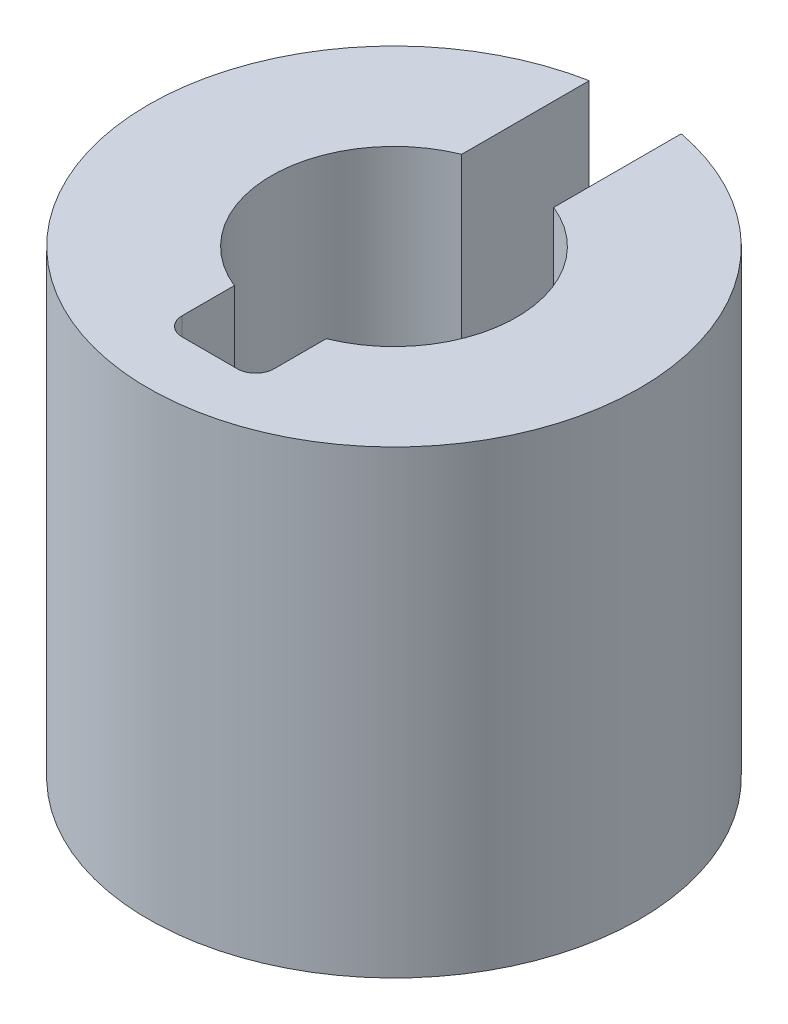
ISO-10303-21;
HEADER;
FILE_DESCRIPTION(('STEP AP214'),'2;1');
FILE_NAME('part.step','',(''),(''),'','','');
FILE_SCHEMA(('AUTOMOTIVE_DESIGN { 1 0 10303 214 1 1 1 1 }'));
ENDSEC;
DATA;
#1=APPLICATION_CONTEXT('core data for automotive mechanical design processes');
#2=APPLICATION_PROTOCOL_DEFINITION('international standard','automotive_design',2000,#1);
#3=PRODUCT_CONTEXT('',#1,'mechanical');
#4=PRODUCT('Part','Part','',(#3));
#5=PRODUCT_RELATED_PRODUCT_CATEGORY('part','',(#4));
#6=PRODUCT_DEFINITION_FORMATION('','',#4);
#7=PRODUCT_DEFINITION_CONTEXT('part definition',#1,'design');
#8=PRODUCT_DEFINITION('design','',#6,#7);
#9=PRODUCT_DEFINITION_SHAPE('','',#8);
#10=(LENGTH_UNIT() NAMED_UNIT(*) SI_UNIT(.MILLI.,.METRE.));
#11=(NAMED_UNIT(*) PLANE_ANGLE_UNIT() SI_UNIT($,.RADIAN.));
#12=(NAMED_UNIT(*) SI_UNIT($,.STERADIAN.) SOLID_ANGLE_UNIT());
#13=UNCERTAINTY_MEASURE_WITH_UNIT(LENGTH_MEASURE(1.E-05),#10,'distance_accuracy_value','');
#14=(GEOMETRIC_REPRESENTATION_CONTEXT(3) GLOBAL_UNCERTAINTY_ASSIGNED_CONTEXT((#13)) GLOBAL_UNIT_ASSIGNED_CONTEXT((#10,
#11,#12)) REPRESENTATION_CONTEXT('',''));
#15=CARTESIAN_POINT('',(0.,0.,0.));
#16=DIRECTION('',(0.,0.,1.));
#17=DIRECTION('',(1.,0.,0.));
#18=AXIS2_PLACEMENT_3D('',#15,#16,#17);
#19=CARTESIAN_POINT('',(-0.75,3.75,3.005));
#20=DIRECTION('',(0.,0.,1.));
#21=DIRECTION('',(1.,0.,0.));
#22=AXIS2_PLACEMENT_3D('',#19,#20,#21);
#23=PLANE('',#22);
#24=DIRECTION('',(0.,1.,0.));
#25=VECTOR('',#24,1.);
#26=CARTESIAN_POINT('',(-0.45,3.75,3.005));
#27=LINE('',#26,#25);
#28=CARTESIAN_POINT('',(-0.45,-3.75,3.005));
#29=VERTEX_POINT('',#28);
#30=CARTESIAN_POINT('',(-0.45,3.75,3.005));
#31=VERTEX_POINT('',#30);
#32=EDGE_CURVE('E145',#29,#31,#27,.T.);
#33=ORIENTED_EDGE('',*,*,#32,.T.);
#34=DIRECTION('',(1.,0.,0.));
#35=VECTOR('',#34,1.);
#36=CARTESIAN_POINT('',(-0.75,3.75,3.005));
#37=LINE('',#36,#35);
#38=CARTESIAN_POINT('',(0.45,3.75,3.005));
#39=VERTEX_POINT('',#38);
#40=EDGE_CURVE('E125',#39,#31,#37,.F.);
#41=ORIENTED_EDGE('',*,*,#40,.F.);
#42=DIRECTION('',(0.,1.,0.));
#43=VECTOR('',#42,1.);
#44=CARTESIAN_POINT('',(0.45,3.75,3.005));
#45=LINE('',#44,#43);
#46=CARTESIAN_POINT('',(0.45,-3.75,3.005));
#47=VERTEX_POINT('',#46);
#48=EDGE_CURVE('E124',#39,#47,#45,.F.);
#49=ORIENTED_EDGE('',*,*,#48,.T.);
#50=DIRECTION('',(1.,0.,0.));
#51=VECTOR('',#50,1.);
#52=CARTESIAN_POINT('',(-0.75,-3.75,3.005));
#53=LINE('',#52,#51);
#54=EDGE_CURVE('E113',#29,#47,#53,.T.);
#55=ORIENTED_EDGE('',*,*,#54,.F.);
#56=EDGE_LOOP('',(#33,#41,#49,#55));
#57=FACE_BOUND('',#56,.T.);
#58=ADVANCED_FACE('F16',(#57),#23,.F.);
#59=CARTESIAN_POINT('',(0.45,3.75,2.705));
#60=DIRECTION('',(0.,1.,0.));
#61=DIRECTION('',(0.,0.,1.));
#62=AXIS2_PLACEMENT_3D('',#59,#60,#61);
#63=CYLINDRICAL_SURFACE('',#62,0.3);
#64=DIRECTION('',(0.,1.,0.));
#65=VECTOR('',#64,1.);
#66=CARTESIAN_POINT('',(0.75,3.75,2.705));
#67=LINE('',#66,#65);
#68=CARTESIAN_POINT('',(0.75,3.75,2.705));
#69=VERTEX_POINT('',#68);
#70=CARTESIAN_POINT('',(0.75,-3.75,2.705));
#71=VERTEX_POINT('',#70);
#72=EDGE_CURVE('E135',#69,#71,#67,.F.);
#73=ORIENTED_EDGE('',*,*,#72,.T.);
#74=CARTESIAN_POINT('',(0.45,-3.75,2.705));
#75=DIRECTION('',(0.,1.,0.));
#76=DIRECTION('',(0.,0.,1.));
#77=AXIS2_PLACEMENT_3D('',#74,#75,#76);
#78=CIRCLE('',#77,0.3);
#79=EDGE_CURVE('E19',#47,#71,#78,.T.);
#80=ORIENTED_EDGE('',*,*,#79,.F.);
#81=ORIENTED_EDGE('',*,*,#48,.F.);
#82=CARTESIAN_POINT('',(0.45,3.75,2.705));
#83=DIRECTION('',(0.,1.,0.));
#84=DIRECTION('',(0.,0.,1.));
#85=AXIS2_PLACEMENT_3D('',#82,#83,#84);
#86=CIRCLE('',#85,0.3);
#87=EDGE_CURVE('E138',#69,#39,#86,.F.);
#88=ORIENTED_EDGE('',*,*,#87,.F.);
#89=EDGE_LOOP('',(#73,#80,#81,#88));
#90=FACE_BOUND('',#89,.T.);
#91=ADVANCED_FACE('F133',(#90),#63,.F.);
#92=CARTESIAN_POINT('',(-0.45,3.75,2.705));
#93=DIRECTION('',(0.,1.,0.));
#94=DIRECTION('',(0.,0.,1.));
#95=AXIS2_PLACEMENT_3D('',#92,#93,#94);
#96=CYLINDRICAL_SURFACE('',#95,0.3);
#97=ORIENTED_EDGE('',*,*,#32,.F.);
#98=CARTESIAN_POINT('',(-0.45,-3.75,2.705));
#99=DIRECTION('',(0.,1.,0.));
#100=DIRECTION('',(0.,0.,1.));
#101=AXIS2_PLACEMENT_3D('',#98,#99,#100);
#102=CIRCLE('',#101,0.3);
#103=CARTESIAN_POINT('',(-0.75,-3.75,2.705));
#104=VERTEX_POINT('',#103);
#105=EDGE_CURVE('E119',#104,#29,#102,.T.);
#106=ORIENTED_EDGE('',*,*,#105,.F.);
#107=DIRECTION('',(0.,1.,0.));
#108=VECTOR('',#107,1.);
#109=CARTESIAN_POINT('',(-0.75,3.75,2.705));
#110=LINE('',#109,#108);
#111=CARTESIAN_POINT('',(-0.75,3.75,2.705));
#112=VERTEX_POINT('',#111);
#113=EDGE_CURVE('E184',#104,#112,#110,.T.);
#114=ORIENTED_EDGE('',*,*,#113,.T.);
#115=CARTESIAN_POINT('',(-0.45,3.75,2.705));
#116=DIRECTION('',(0.,1.,0.));
#117=DIRECTION('',(0.,0.,1.));
#118=AXIS2_PLACEMENT_3D('',#115,#116,#117);
#119=CIRCLE('',#118,0.3);
#120=EDGE_CURVE('E148',#31,#112,#119,.F.);
#121=ORIENTED_EDGE('',*,*,#120,.F.);
#122=EDGE_LOOP('',(#97,#106,#114,#121));
#123=FACE_BOUND('',#122,.T.);
#124=ADVANCED_FACE('F235',(#123),#96,.F.);
#125=CARTESIAN_POINT('',(0.75,3.75,3.005));
#126=DIRECTION('',(1.,0.,0.));
#127=DIRECTION('',(0.,0.,-1.));
#128=AXIS2_PLACEMENT_3D('',#125,#126,#127);
#129=PLANE('',#128);
#130=ORIENTED_EDGE('',*,*,#72,.F.);
#131=DIRECTION('',(0.,0.,-1.));
#132=VECTOR('',#131,1.);
#133=CARTESIAN_POINT('',(0.75,3.75,3.005));
#134=LINE('',#133,#132);
#135=CARTESIAN_POINT('',(0.75,3.75,1.85404962177392));
#136=VERTEX_POINT('',#135);
#137=EDGE_CURVE('E151',#136,#69,#134,.F.);
#138=ORIENTED_EDGE('',*,*,#137,.F.);
#139=DIRECTION('',(0.,-1.,0.));
#140=VECTOR('',#139,1.);
#141=CARTESIAN_POINT('',(0.75,3.75,1.85404962177392));
#142=LINE('',#141,#140);
#143=CARTESIAN_POINT('',(0.75,-3.75,1.85404962177392));
#144=VERTEX_POINT('',#143);
#145=EDGE_CURVE('E195',#136,#144,#142,.T.);
#146=ORIENTED_EDGE('',*,*,#145,.T.);
#147=DIRECTION('',(0.,0.,-1.));
#148=VECTOR('',#147,1.);
#149=CARTESIAN_POINT('',(0.75,-3.75,3.005));
#150=LINE('',#149,#148);
#151=EDGE_CURVE('E183',#71,#144,#150,.T.);
#152=ORIENTED_EDGE('',*,*,#151,.F.);
#153=EDGE_LOOP('',(#130,#138,#146,#152));
#154=FACE_BOUND('',#153,.T.);
#155=ADVANCED_FACE('F232',(#154),#129,.F.);
#156=CARTESIAN_POINT('',(-0.75,3.75,3.005));
#157=DIRECTION('',(-1.,0.,0.));
#158=DIRECTION('',(0.,0.,1.));
#159=AXIS2_PLACEMENT_3D('',#156,#157,#158);
#160=PLANE('',#159);
#161=ORIENTED_EDGE('',*,*,#113,.F.);
#162=DIRECTION('',(0.,0.,1.));
#163=VECTOR('',#162,1.);
#164=CARTESIAN_POINT('',(-0.75,-3.75,3.005));
#165=LINE('',#164,#163);
#166=CARTESIAN_POINT('',(-0.75,-3.75,1.85404962177392));
#167=VERTEX_POINT('',#166);
#168=EDGE_CURVE('E189',#167,#104,#165,.T.);
#169=ORIENTED_EDGE('',*,*,#168,.F.);
#170=DIRECTION('',(0.,-1.,0.));
#171=VECTOR('',#170,1.);
#172=CARTESIAN_POINT('',(-0.749999999999999,3.75,1.85404962177392));
#173=LINE('',#172,#171);
#174=CARTESIAN_POINT('',(-0.75,3.75,1.85404962177392));
#175=VERTEX_POINT('',#174);
#176=EDGE_CURVE('E156',#167,#175,#173,.F.);
#177=ORIENTED_EDGE('',*,*,#176,.T.);
#178=DIRECTION('',(0.,0.,1.));
#179=VECTOR('',#178,1.);
#180=CARTESIAN_POINT('',(-0.75,3.75,3.005));
#181=LINE('',#180,#179);
#182=EDGE_CURVE('E188',#112,#175,#181,.F.);
#183=ORIENTED_EDGE('',*,*,#182,.F.);
#184=EDGE_LOOP('',(#161,#169,#177,#183));
#185=FACE_BOUND('',#184,.T.);
#186=ADVANCED_FACE('F234',(#185),#160,.F.);
#187=CARTESIAN_POINT('',(0.,3.75,0.));
#188=DIRECTION('',(0.,-1.,0.));
#189=DIRECTION('',(0.,0.,-1.));
#190=AXIS2_PLACEMENT_3D('',#187,#188,#189);
#191=CYLINDRICAL_SURFACE('',#190,2.);
#192=ORIENTED_EDGE('',*,*,#145,.F.);
#193=CARTESIAN_POINT('',(0.,3.75,0.));
#194=DIRECTION('',(0.,-1.,0.));
#195=DIRECTION('',(0.,0.,-1.));
#196=AXIS2_PLACEMENT_3D('',#193,#194,#195);
#197=CIRCLE('',#196,2.);
#198=CARTESIAN_POINT('',(0.75,3.75,-1.85404962177392));
#199=VERTEX_POINT('',#198);
#200=EDGE_CURVE('E161',#199,#136,#197,.T.);
#201=ORIENTED_EDGE('',*,*,#200,.F.);
#202=DIRECTION('',(0.,1.,0.));
#203=VECTOR('',#202,1.);
#204=CARTESIAN_POINT('',(0.75,3.75,-1.85404962177392));
#205=LINE('',#204,#203);
#206=CARTESIAN_POINT('',(0.75,-3.75,-1.85404962177392));
#207=VERTEX_POINT('',#206);
#208=EDGE_CURVE('E160',#199,#207,#205,.F.);
#209=ORIENTED_EDGE('',*,*,#208,.T.);
#210=CARTESIAN_POINT('',(0.,-3.75,0.));
#211=DIRECTION('',(0.,-1.,0.));
#212=DIRECTION('',(0.,0.,-1.));
#213=AXIS2_PLACEMENT_3D('',#210,#211,#212);
#214=CIRCLE('',#213,2.);
#215=EDGE_CURVE('E155',#207,#144,#214,.T.);
#216=ORIENTED_EDGE('',*,*,#215,.T.);
#217=EDGE_LOOP('',(#192,#201,#209,#216));
#218=FACE_BOUND('',#217,.T.);
#219=ADVANCED_FACE('F230',(#218),#191,.F.);
#220=CARTESIAN_POINT('',(0.,3.75,0.));
#221=DIRECTION('',(0.,-1.,0.));
#222=DIRECTION('',(0.,0.,-1.));
#223=AXIS2_PLACEMENT_3D('',#220,#221,#222);
#224=CYLINDRICAL_SURFACE('',#223,2.);
#225=DIRECTION('',(0.,1.,0.));
#226=VECTOR('',#225,1.);
#227=CARTESIAN_POINT('',(-0.75,3.75,-1.85404962177392));
#228=LINE('',#227,#226);
#229=CARTESIAN_POINT('',(-0.75,-3.75,-1.85404962177392));
#230=VERTEX_POINT('',#229);
#231=CARTESIAN_POINT('',(-0.75,3.75,-1.85404962177392));
#232=VERTEX_POINT('',#231);
#233=EDGE_CURVE('E206',#230,#232,#228,.T.);
#234=ORIENTED_EDGE('',*,*,#233,.T.);
#235=CARTESIAN_POINT('',(0.,3.75,0.));
#236=DIRECTION('',(0.,-1.,0.));
#237=DIRECTION('',(0.,0.,-1.));
#238=AXIS2_PLACEMENT_3D('',#235,#236,#237);
#239=CIRCLE('',#238,2.);
#240=EDGE_CURVE('E165',#175,#232,#239,.T.);
#241=ORIENTED_EDGE('',*,*,#240,.F.);
#242=ORIENTED_EDGE('',*,*,#176,.F.);
#243=CARTESIAN_POINT('',(0.,-3.75,0.));
#244=DIRECTION('',(0.,-1.,0.));
#245=DIRECTION('',(0.,0.,-1.));
#246=AXIS2_PLACEMENT_3D('',#243,#244,#245);
#247=CIRCLE('',#246,2.);
#248=EDGE_CURVE('E152',#167,#230,#247,.T.);
#249=ORIENTED_EDGE('',*,*,#248,.T.);
#250=EDGE_LOOP('',(#234,#241,#242,#249));
#251=FACE_BOUND('',#250,.T.);
#252=ADVANCED_FACE('F264',(#251),#224,.F.);
#253=CARTESIAN_POINT('',(0.,-3.75,0.));
#254=DIRECTION('',(0.,1.,0.));
#255=DIRECTION('',(0.,0.,1.));
#256=AXIS2_PLACEMENT_3D('',#253,#254,#255);
#257=PLANE('',#256);
#258=DIRECTION('',(0.,0.,-1.));
#259=VECTOR('',#258,1.);
#260=CARTESIAN_POINT('',(0.75,-3.75,-1.85404962177392));
#261=LINE('',#260,#259);
#262=CARTESIAN_POINT('',(0.75,-3.75,-3.9341485737069));
#263=VERTEX_POINT('',#262);
#264=EDGE_CURVE('E166',#207,#263,#261,.T.);
#265=ORIENTED_EDGE('',*,*,#264,.T.);
#266=CARTESIAN_POINT('',(0.,-3.75,0.));
#267=DIRECTION('',(0.,-1.,0.));
#268=DIRECTION('',(0.,0.,-1.));
#269=AXIS2_PLACEMENT_3D('',#266,#267,#268);
#270=CIRCLE('',#269,4.005);
#271=CARTESIAN_POINT('',(-0.75,-3.75,-3.9341485737069));
#272=VERTEX_POINT('',#271);
#273=EDGE_CURVE('E170',#272,#263,#270,.F.);
#274=ORIENTED_EDGE('',*,*,#273,.F.);
#275=DIRECTION('',(0.,0.,1.));
#276=VECTOR('',#275,1.);
#277=CARTESIAN_POINT('',(-0.75,-3.75,-1.85404962177392));
#278=LINE('',#277,#276);
#279=EDGE_CURVE('E175',#272,#230,#278,.T.);
#280=ORIENTED_EDGE('',*,*,#279,.T.);
#281=ORIENTED_EDGE('',*,*,#248,.F.);
#282=ORIENTED_EDGE('',*,*,#168,.T.);
#283=ORIENTED_EDGE('',*,*,#105,.T.);
#284=ORIENTED_EDGE('',*,*,#54,.T.);
#285=ORIENTED_EDGE('',*,*,#79,.T.);
#286=ORIENTED_EDGE('',*,*,#151,.T.);
#287=ORIENTED_EDGE('',*,*,#215,.F.);
#288=EDGE_LOOP('',(#265,#274,#280,#281,#282,#283,#284,#285,#286,#287));
#289=FACE_BOUND('',#288,.T.);
#290=ADVANCED_FACE('F115',(#289),#257,.F.);
#291=CARTESIAN_POINT('',(0.75,3.75,-1.85404962177392));
#292=DIRECTION('',(1.,0.,0.));
#293=DIRECTION('',(0.,0.,-1.));
#294=AXIS2_PLACEMENT_3D('',#291,#292,#293);
#295=PLANE('',#294);
#296=ORIENTED_EDGE('',*,*,#208,.F.);
#297=DIRECTION('',(0.,0.,1.));
#298=VECTOR('',#297,1.);
#299=CARTESIAN_POINT('',(0.75,3.75,0.));
#300=LINE('',#299,#298);
#301=CARTESIAN_POINT('',(0.75,3.75,-3.9341485737069));
#302=VERTEX_POINT('',#301);
#303=EDGE_CURVE('E169',#302,#199,#300,.T.);
#304=ORIENTED_EDGE('',*,*,#303,.F.);
#305=DIRECTION('',(0.,-1.,0.));
#306=VECTOR('',#305,1.);
#307=CARTESIAN_POINT('',(0.75,3.75,-3.9341485737069));
#308=LINE('',#307,#306);
#309=EDGE_CURVE('E174',#263,#302,#308,.F.);
#310=ORIENTED_EDGE('',*,*,#309,.F.);
#311=ORIENTED_EDGE('',*,*,#264,.F.);
#312=EDGE_LOOP('',(#296,#304,#310,#311));
#313=FACE_BOUND('',#312,.T.);
#314=ADVANCED_FACE('F225',(#313),#295,.F.);
#315=CARTESIAN_POINT('',(0.,3.75,0.));
#316=DIRECTION('',(0.,1.,0.));
#317=DIRECTION('',(0.,0.,1.));
#318=AXIS2_PLACEMENT_3D('',#315,#316,#317);
#319=PLANE('',#318);
#320=CARTESIAN_POINT('',(0.,3.75,0.));
#321=DIRECTION('',(0.,-1.,0.));
#322=DIRECTION('',(0.,0.,-1.));
#323=AXIS2_PLACEMENT_3D('',#320,#321,#322);
#324=CIRCLE('',#323,4.005);
#325=CARTESIAN_POINT('',(-0.75,3.75,-3.9341485737069));
#326=VERTEX_POINT('',#325);
#327=EDGE_CURVE('E26',#302,#326,#324,.T.);
#328=ORIENTED_EDGE('',*,*,#327,.F.);
#329=ORIENTED_EDGE('',*,*,#303,.T.);
#330=ORIENTED_EDGE('',*,*,#200,.T.);
#331=ORIENTED_EDGE('',*,*,#137,.T.);
#332=ORIENTED_EDGE('',*,*,#87,.T.);
#333=ORIENTED_EDGE('',*,*,#40,.T.);
#334=ORIENTED_EDGE('',*,*,#120,.T.);
#335=ORIENTED_EDGE('',*,*,#182,.T.);
#336=ORIENTED_EDGE('',*,*,#240,.T.);
#337=DIRECTION('',(0.,0.,1.));
#338=VECTOR('',#337,1.);
#339=CARTESIAN_POINT('',(-0.75,3.75,-1.85404962177392));
#340=LINE('',#339,#338);
#341=EDGE_CURVE('E39',#232,#326,#340,.F.);
#342=ORIENTED_EDGE('',*,*,#341,.T.);
#343=EDGE_LOOP('',(#328,#329,#330,#331,#332,#333,#334,#335,#336,#342));
#344=FACE_BOUND('',#343,.T.);
#345=ADVANCED_FACE('F221',(#344),#319,.T.);
#346=CARTESIAN_POINT('',(-0.75,3.75,-1.85404962177392));
#347=DIRECTION('',(-1.,0.,0.));
#348=DIRECTION('',(0.,0.,1.));
#349=AXIS2_PLACEMENT_3D('',#346,#347,#348);
#350=PLANE('',#349);
#351=DIRECTION('',(0.,-1.,0.));
#352=VECTOR('',#351,1.);
#353=CARTESIAN_POINT('',(-0.75,3.75,-3.9341485737069));
#354=LINE('',#353,#352);
#355=EDGE_CURVE('E11',#326,#272,#354,.T.);
#356=ORIENTED_EDGE('',*,*,#355,.F.);
#357=ORIENTED_EDGE('',*,*,#341,.F.);
#358=ORIENTED_EDGE('',*,*,#233,.F.);
#359=ORIENTED_EDGE('',*,*,#279,.F.);
#360=EDGE_LOOP('',(#356,#357,#358,#359));
#361=FACE_BOUND('',#360,.T.);
#362=ADVANCED_FACE('F248',(#361),#350,.F.);
#363=CARTESIAN_POINT('',(0.,3.75,0.));
#364=DIRECTION('',(0.,-1.,0.));
#365=DIRECTION('',(0.,0.,-1.));
#366=AXIS2_PLACEMENT_3D('',#363,#364,#365);
#367=CYLINDRICAL_SURFACE('',#366,4.005);
#368=ORIENTED_EDGE('',*,*,#327,.T.);
#369=ORIENTED_EDGE('',*,*,#355,.T.);
#370=ORIENTED_EDGE('',*,*,#273,.T.);
#371=ORIENTED_EDGE('',*,*,#309,.T.);
#372=EDGE_LOOP('',(#368,#369,#370,#371));
#373=FACE_BOUND('',#372,.T.);
#374=ADVANCED_FACE('F246',(#373),#367,.T.);
#375=CLOSED_SHELL('',(#58,#91,#124,#155,#186,#219,#252,#290,#314,#345,#362,#374));
#376=MANIFOLD_SOLID_BREP('B1',#375);
#377=ADVANCED_BREP_SHAPE_REPRESENTATION('',(#18,#376),#14);
#378=SHAPE_DEFINITION_REPRESENTATION(#9,#377);
ENDSEC;
END-ISO-10303-21;
